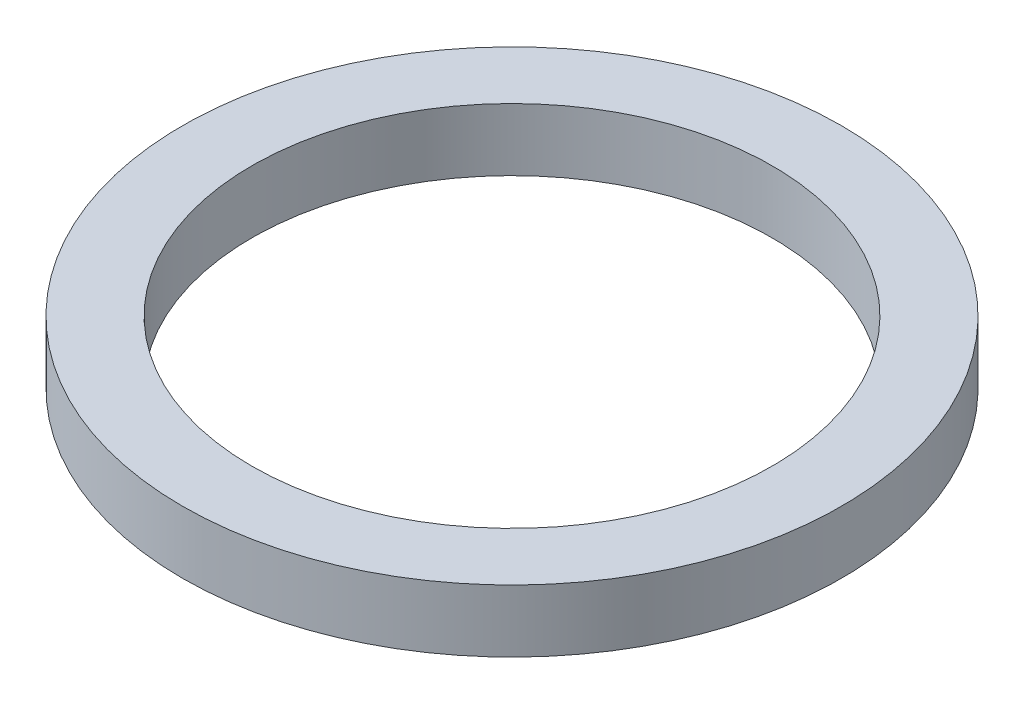
ISO-10303-21;
HEADER;
FILE_DESCRIPTION(('STEP AP214'),'2;1');
FILE_NAME('part.step','',(''),(''),'','','');
FILE_SCHEMA(('AUTOMOTIVE_DESIGN { 1 0 10303 214 1 1 1 1 }'));
ENDSEC;
DATA;
#1=APPLICATION_CONTEXT('core data for automotive mechanical design processes');
#2=APPLICATION_PROTOCOL_DEFINITION('international standard','automotive_design',2000,#1);
#3=PRODUCT_CONTEXT('',#1,'mechanical');
#4=PRODUCT('Part','Part','',(#3));
#5=PRODUCT_RELATED_PRODUCT_CATEGORY('part','',(#4));
#6=PRODUCT_DEFINITION_FORMATION('','',#4);
#7=PRODUCT_DEFINITION_CONTEXT('part definition',#1,'design');
#8=PRODUCT_DEFINITION('design','',#6,#7);
#9=PRODUCT_DEFINITION_SHAPE('','',#8);
#10=(LENGTH_UNIT() NAMED_UNIT(*) SI_UNIT(.MILLI.,.METRE.));
#11=(NAMED_UNIT(*) PLANE_ANGLE_UNIT() SI_UNIT($,.RADIAN.));
#12=(NAMED_UNIT(*) SI_UNIT($,.STERADIAN.) SOLID_ANGLE_UNIT());
#13=UNCERTAINTY_MEASURE_WITH_UNIT(LENGTH_MEASURE(1.E-05),#10,'distance_accuracy_value','');
#14=(GEOMETRIC_REPRESENTATION_CONTEXT(3) GLOBAL_UNCERTAINTY_ASSIGNED_CONTEXT((#13)) GLOBAL_UNIT_ASSIGNED_CONTEXT((#10,
#11,#12)) REPRESENTATION_CONTEXT('',''));
#15=CARTESIAN_POINT('',(0.,0.,0.));
#16=DIRECTION('',(0.,0.,1.));
#17=DIRECTION('',(1.,0.,0.));
#18=AXIS2_PLACEMENT_3D('',#15,#16,#17);
#19=CARTESIAN_POINT('',(0.,9.,0.));
#20=DIRECTION('',(0.,1.,0.));
#21=DIRECTION('',(0.,0.,1.));
#22=AXIS2_PLACEMENT_3D('',#19,#20,#21);
#23=PLANE('',#22);
#24=CARTESIAN_POINT('',(0.,9.,0.));
#25=DIRECTION('',(0.,1.,0.));
#26=DIRECTION('',(0.,0.,1.));
#27=AXIS2_PLACEMENT_3D('',#24,#25,#26);
#28=CIRCLE('',#27,47.5);
#29=CARTESIAN_POINT('',(0.,9.,47.5));
#30=VERTEX_POINT('',#29);
#31=EDGE_CURVE('E10',#30,#30,#28,.T.);
#32=ORIENTED_EDGE('',*,*,#31,.T.);
#33=EDGE_LOOP('',(#32));
#34=FACE_BOUND('',#33,.T.);
#35=CARTESIAN_POINT('',(0.,9.,0.));
#36=DIRECTION('',(0.,1.,0.));
#37=DIRECTION('',(0.,0.,1.));
#38=AXIS2_PLACEMENT_3D('',#35,#36,#37);
#39=CIRCLE('',#38,37.5);
#40=CARTESIAN_POINT('',(0.,9.,37.5));
#41=VERTEX_POINT('',#40);
#42=EDGE_CURVE('E41',#41,#41,#39,.T.);
#43=ORIENTED_EDGE('',*,*,#42,.F.);
#44=EDGE_LOOP('',(#43));
#45=FACE_BOUND('',#44,.T.);
#46=ADVANCED_FACE('F30',(#34,#45),#23,.T.);
#47=CARTESIAN_POINT('',(0.,0.,0.));
#48=DIRECTION('',(0.,1.,0.));
#49=DIRECTION('',(0.,0.,1.));
#50=AXIS2_PLACEMENT_3D('',#47,#48,#49);
#51=PLANE('',#50);
#52=CARTESIAN_POINT('',(0.,0.,0.));
#53=DIRECTION('',(0.,1.,0.));
#54=DIRECTION('',(0.,0.,1.));
#55=AXIS2_PLACEMENT_3D('',#52,#53,#54);
#56=CIRCLE('',#55,47.5);
#57=CARTESIAN_POINT('',(0.,0.,47.5));
#58=VERTEX_POINT('',#57);
#59=EDGE_CURVE('E34',#58,#58,#56,.T.);
#60=ORIENTED_EDGE('',*,*,#59,.F.);
#61=EDGE_LOOP('',(#60));
#62=FACE_BOUND('',#61,.T.);
#63=CARTESIAN_POINT('',(0.,0.,0.));
#64=DIRECTION('',(0.,1.,0.));
#65=DIRECTION('',(0.,0.,1.));
#66=AXIS2_PLACEMENT_3D('',#63,#64,#65);
#67=CIRCLE('',#66,37.5);
#68=CARTESIAN_POINT('',(0.,0.,37.5));
#69=VERTEX_POINT('',#68);
#70=EDGE_CURVE('E43',#69,#69,#67,.T.);
#71=ORIENTED_EDGE('',*,*,#70,.T.);
#72=EDGE_LOOP('',(#71));
#73=FACE_BOUND('',#72,.T.);
#74=ADVANCED_FACE('F53',(#62,#73),#51,.F.);
#75=CARTESIAN_POINT('',(0.,9.,0.));
#76=DIRECTION('',(0.,-1.,0.));
#77=DIRECTION('',(0.,0.,-1.));
#78=AXIS2_PLACEMENT_3D('',#75,#76,#77);
#79=CYLINDRICAL_SURFACE('',#78,47.5);
#80=ORIENTED_EDGE('',*,*,#31,.F.);
#81=EDGE_LOOP('',(#80));
#82=FACE_BOUND('',#81,.T.);
#83=ORIENTED_EDGE('',*,*,#59,.T.);
#84=EDGE_LOOP('',(#83));
#85=FACE_BOUND('',#84,.T.);
#86=ADVANCED_FACE('F32',(#82,#85),#79,.T.);
#87=CARTESIAN_POINT('',(0.,9.,0.));
#88=DIRECTION('',(0.,-1.,0.));
#89=DIRECTION('',(0.,0.,-1.));
#90=AXIS2_PLACEMENT_3D('',#87,#88,#89);
#91=CYLINDRICAL_SURFACE('',#90,37.5);
#92=ORIENTED_EDGE('',*,*,#42,.T.);
#93=EDGE_LOOP('',(#92));
#94=FACE_BOUND('',#93,.T.);
#95=ORIENTED_EDGE('',*,*,#70,.F.);
#96=EDGE_LOOP('',(#95));
#97=FACE_BOUND('',#96,.T.);
#98=ADVANCED_FACE('F49',(#94,#97),#91,.F.);
#99=CLOSED_SHELL('',(#46,#74,#86,#98));
#100=MANIFOLD_SOLID_BREP('B2',#99);
#101=ADVANCED_BREP_SHAPE_REPRESENTATION('',(#18,#100),#14);
#102=SHAPE_DEFINITION_REPRESENTATION(#9,#101);
ENDSEC;
END-ISO-10303-21;
